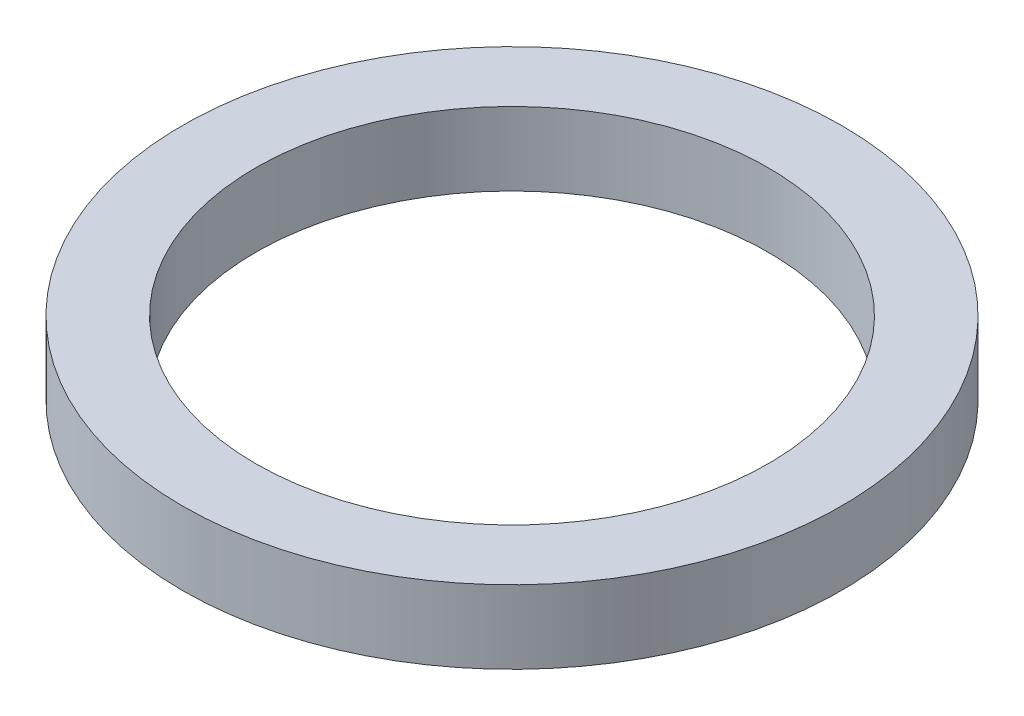
ISO-10303-21;
HEADER;
FILE_DESCRIPTION(('STEP AP214'),'2;1');
FILE_NAME('part.step','',(''),(''),'','','');
FILE_SCHEMA(('AUTOMOTIVE_DESIGN { 1 0 10303 214 1 1 1 1 }'));
ENDSEC;
DATA;
#1=APPLICATION_CONTEXT('core data for automotive mechanical design processes');
#2=APPLICATION_PROTOCOL_DEFINITION('international standard','automotive_design',2000,#1);
#3=PRODUCT_CONTEXT('',#1,'mechanical');
#4=PRODUCT('Part','Part','',(#3));
#5=PRODUCT_RELATED_PRODUCT_CATEGORY('part','',(#4));
#6=PRODUCT_DEFINITION_FORMATION('','',#4);
#7=PRODUCT_DEFINITION_CONTEXT('part definition',#1,'design');
#8=PRODUCT_DEFINITION('design','',#6,#7);
#9=PRODUCT_DEFINITION_SHAPE('','',#8);
#10=(LENGTH_UNIT() NAMED_UNIT(*) SI_UNIT(.MILLI.,.METRE.));
#11=(NAMED_UNIT(*) PLANE_ANGLE_UNIT() SI_UNIT($,.RADIAN.));
#12=(NAMED_UNIT(*) SI_UNIT($,.STERADIAN.) SOLID_ANGLE_UNIT());
#13=UNCERTAINTY_MEASURE_WITH_UNIT(LENGTH_MEASURE(1.E-05),#10,'distance_accuracy_value','');
#14=(GEOMETRIC_REPRESENTATION_CONTEXT(3) GLOBAL_UNCERTAINTY_ASSIGNED_CONTEXT((#13)) GLOBAL_UNIT_ASSIGNED_CONTEXT((#10,
#11,#12)) REPRESENTATION_CONTEXT('',''));
#15=CARTESIAN_POINT('',(0.,0.,0.));
#16=DIRECTION('',(0.,0.,1.));
#17=DIRECTION('',(1.,0.,0.));
#18=AXIS2_PLACEMENT_3D('',#15,#16,#17);
#19=CARTESIAN_POINT('',(0.,2.,0.));
#20=DIRECTION('',(0.,-1.,0.));
#21=DIRECTION('',(0.,0.,-1.));
#22=AXIS2_PLACEMENT_3D('',#19,#20,#21);
#23=CYLINDRICAL_SURFACE('',#22,9.);
#24=CARTESIAN_POINT('',(0.,2.,0.));
#25=DIRECTION('',(0.,1.,0.));
#26=DIRECTION('',(0.,0.,1.));
#27=AXIS2_PLACEMENT_3D('',#24,#25,#26);
#28=CIRCLE('',#27,9.);
#29=CARTESIAN_POINT('',(0.,2.,9.));
#30=VERTEX_POINT('',#29);
#31=EDGE_CURVE('E10',#30,#30,#28,.T.);
#32=ORIENTED_EDGE('',*,*,#31,.F.);
#33=EDGE_LOOP('',(#32));
#34=FACE_BOUND('',#33,.T.);
#35=CARTESIAN_POINT('',(0.,0.,0.));
#36=DIRECTION('',(0.,1.,0.));
#37=DIRECTION('',(0.,0.,1.));
#38=AXIS2_PLACEMENT_3D('',#35,#36,#37);
#39=CIRCLE('',#38,9.);
#40=CARTESIAN_POINT('',(0.,0.,9.));
#41=VERTEX_POINT('',#40);
#42=EDGE_CURVE('E34',#41,#41,#39,.T.);
#43=ORIENTED_EDGE('',*,*,#42,.T.);
#44=EDGE_LOOP('',(#43));
#45=FACE_BOUND('',#44,.T.);
#46=ADVANCED_FACE('F31',(#34,#45),#23,.T.);
#47=CARTESIAN_POINT('',(0.,2.,0.));
#48=DIRECTION('',(0.,1.,0.));
#49=DIRECTION('',(0.,0.,1.));
#50=AXIS2_PLACEMENT_3D('',#47,#48,#49);
#51=PLANE('',#50);
#52=CARTESIAN_POINT('',(0.,2.,0.));
#53=DIRECTION('',(0.,1.,0.));
#54=DIRECTION('',(0.,0.,1.));
#55=AXIS2_PLACEMENT_3D('',#52,#53,#54);
#56=CIRCLE('',#55,7.);
#57=CARTESIAN_POINT('',(0.,2.,7.));
#58=VERTEX_POINT('',#57);
#59=EDGE_CURVE('E43',#58,#58,#56,.T.);
#60=ORIENTED_EDGE('',*,*,#59,.F.);
#61=EDGE_LOOP('',(#60));
#62=FACE_BOUND('',#61,.T.);
#63=ORIENTED_EDGE('',*,*,#31,.T.);
#64=EDGE_LOOP('',(#63));
#65=FACE_BOUND('',#64,.T.);
#66=ADVANCED_FACE('F58',(#62,#65),#51,.T.);
#67=CARTESIAN_POINT('',(0.,0.,0.));
#68=DIRECTION('',(0.,1.,0.));
#69=DIRECTION('',(0.,0.,1.));
#70=AXIS2_PLACEMENT_3D('',#67,#68,#69);
#71=PLANE('',#70);
#72=CARTESIAN_POINT('',(0.,0.,0.));
#73=DIRECTION('',(0.,1.,0.));
#74=DIRECTION('',(0.,0.,1.));
#75=AXIS2_PLACEMENT_3D('',#72,#73,#74);
#76=CIRCLE('',#75,7.);
#77=CARTESIAN_POINT('',(0.,0.,7.));
#78=VERTEX_POINT('',#77);
#79=EDGE_CURVE('E41',#78,#78,#76,.T.);
#80=ORIENTED_EDGE('',*,*,#79,.T.);
#81=EDGE_LOOP('',(#80));
#82=FACE_BOUND('',#81,.T.);
#83=ORIENTED_EDGE('',*,*,#42,.F.);
#84=EDGE_LOOP('',(#83));
#85=FACE_BOUND('',#84,.T.);
#86=ADVANCED_FACE('F49',(#82,#85),#71,.F.);
#87=CARTESIAN_POINT('',(0.,0.,0.));
#88=DIRECTION('',(0.,1.,0.));
#89=DIRECTION('',(0.,0.,1.));
#90=AXIS2_PLACEMENT_3D('',#87,#88,#89);
#91=CYLINDRICAL_SURFACE('',#90,7.);
#92=ORIENTED_EDGE('',*,*,#79,.F.);
#93=EDGE_LOOP('',(#92));
#94=FACE_BOUND('',#93,.T.);
#95=ORIENTED_EDGE('',*,*,#59,.T.);
#96=EDGE_LOOP('',(#95));
#97=FACE_BOUND('',#96,.T.);
#98=ADVANCED_FACE('F52',(#94,#97),#91,.F.);
#99=CLOSED_SHELL('',(#46,#66,#86,#98));
#100=MANIFOLD_SOLID_BREP('B2',#99);
#101=ADVANCED_BREP_SHAPE_REPRESENTATION('',(#18,#100),#14);
#102=SHAPE_DEFINITION_REPRESENTATION(#9,#101);
ENDSEC;
END-ISO-10303-21;
